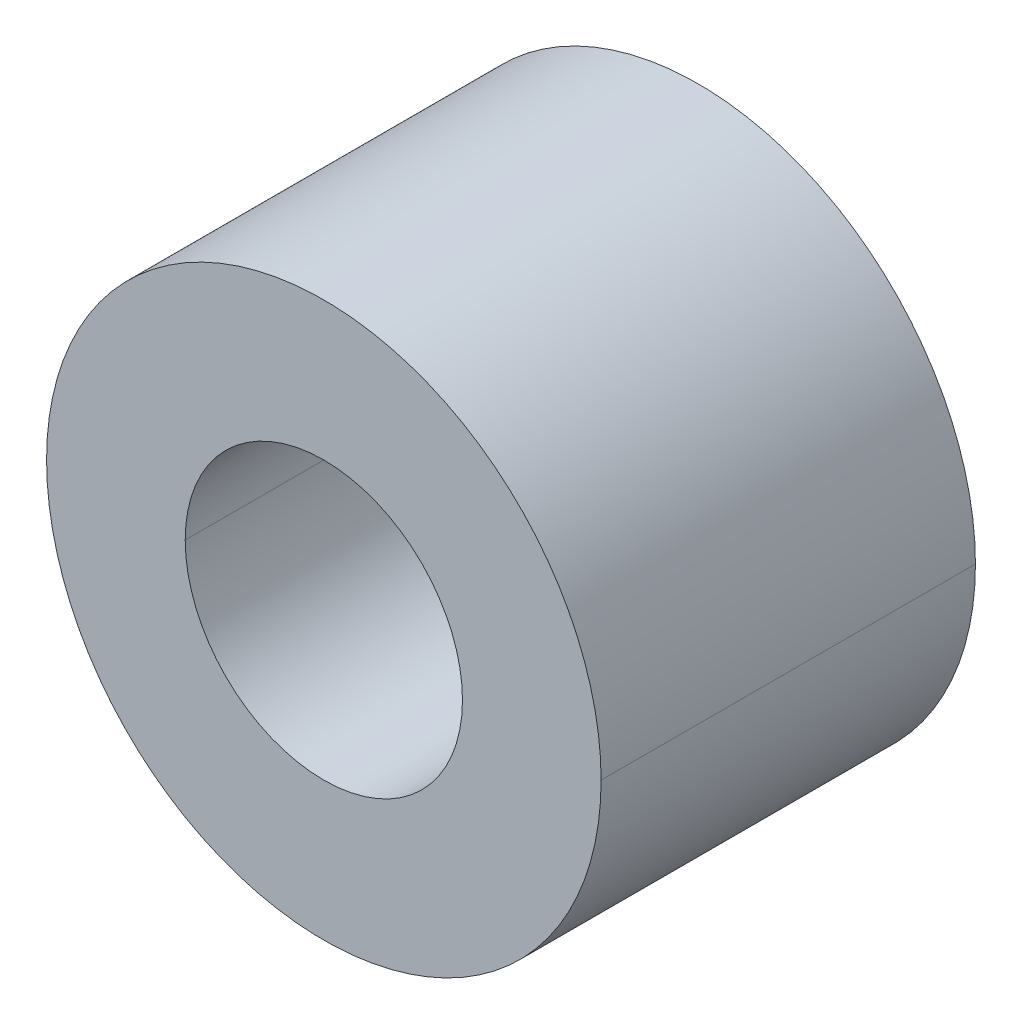
ISO-10303-21;
HEADER;
FILE_DESCRIPTION(('STEP AP214'),'2;1');
FILE_NAME('part.step','',(''),(''),'','','');
FILE_SCHEMA(('AUTOMOTIVE_DESIGN { 1 0 10303 214 1 1 1 1 }'));
ENDSEC;
DATA;
#1=APPLICATION_CONTEXT('core data for automotive mechanical design processes');
#2=APPLICATION_PROTOCOL_DEFINITION('international standard','automotive_design',2000,#1);
#3=PRODUCT_CONTEXT('',#1,'mechanical');
#4=PRODUCT('Part','Part','',(#3));
#5=PRODUCT_RELATED_PRODUCT_CATEGORY('part','',(#4));
#6=PRODUCT_DEFINITION_FORMATION('','',#4);
#7=PRODUCT_DEFINITION_CONTEXT('part definition',#1,'design');
#8=PRODUCT_DEFINITION('design','',#6,#7);
#9=PRODUCT_DEFINITION_SHAPE('','',#8);
#10=(LENGTH_UNIT() NAMED_UNIT(*) SI_UNIT(.MILLI.,.METRE.));
#11=(NAMED_UNIT(*) PLANE_ANGLE_UNIT() SI_UNIT($,.RADIAN.));
#12=(NAMED_UNIT(*) SI_UNIT($,.STERADIAN.) SOLID_ANGLE_UNIT());
#13=UNCERTAINTY_MEASURE_WITH_UNIT(LENGTH_MEASURE(1.E-05),#10,'distance_accuracy_value','');
#14=(GEOMETRIC_REPRESENTATION_CONTEXT(3) GLOBAL_UNCERTAINTY_ASSIGNED_CONTEXT((#13)) GLOBAL_UNIT_ASSIGNED_CONTEXT((#10,
#11,#12)) REPRESENTATION_CONTEXT('',''));
#15=CARTESIAN_POINT('',(0.,0.,0.));
#16=DIRECTION('',(0.,0.,1.));
#17=DIRECTION('',(1.,0.,0.));
#18=AXIS2_PLACEMENT_3D('',#15,#16,#17);
#19=CARTESIAN_POINT('',(0.,0.,2.7));
#20=DIRECTION('',(0.,0.,-1.));
#21=DIRECTION('',(-1.,0.,0.));
#22=AXIS2_PLACEMENT_3D('',#19,#20,#21);
#23=CYLINDRICAL_SURFACE('',#22,2.);
#24=CARTESIAN_POINT('',(0.,0.,2.7));
#25=DIRECTION('',(0.,0.,1.));
#26=DIRECTION('',(1.,0.,0.));
#27=AXIS2_PLACEMENT_3D('',#24,#25,#26);
#28=CIRCLE('',#27,2.);
#29=CARTESIAN_POINT('',(2.,0.,2.7));
#30=VERTEX_POINT('',#29);
#31=CARTESIAN_POINT('',(-2.,0.,2.7));
#32=VERTEX_POINT('',#31);
#33=EDGE_CURVE('E76',#30,#32,#28,.T.);
#34=ORIENTED_EDGE('',*,*,#33,.F.);
#35=DIRECTION('',(0.,0.,-1.));
#36=VECTOR('',#35,1.);
#37=CARTESIAN_POINT('',(2.,0.,2.69999999925));
#38=LINE('',#37,#36);
#39=CARTESIAN_POINT('',(2.,0.,7.45058237328E-10));
#40=VERTEX_POINT('',#39);
#41=EDGE_CURVE('E27',#30,#40,#38,.T.);
#42=ORIENTED_EDGE('',*,*,#41,.T.);
#43=CARTESIAN_POINT('',(0.,0.,0.));
#44=DIRECTION('',(0.,0.,1.));
#45=DIRECTION('',(1.,0.,0.));
#46=AXIS2_PLACEMENT_3D('',#43,#44,#45);
#47=CIRCLE('',#46,2.);
#48=CARTESIAN_POINT('',(-2.,0.,7.45058237328E-10));
#49=VERTEX_POINT('',#48);
#50=EDGE_CURVE('E74',#40,#49,#47,.T.);
#51=ORIENTED_EDGE('',*,*,#50,.T.);
#52=DIRECTION('',(0.,0.,-1.));
#53=VECTOR('',#52,1.);
#54=CARTESIAN_POINT('',(-2.,0.,2.69999999925));
#55=LINE('',#54,#53);
#56=EDGE_CURVE('E11',#32,#49,#55,.T.);
#57=ORIENTED_EDGE('',*,*,#56,.F.);
#58=EDGE_LOOP('',(#34,#42,#51,#57));
#59=FACE_BOUND('',#58,.T.);
#60=ADVANCED_FACE('F17',(#59),#23,.T.);
#61=CARTESIAN_POINT('',(0.,0.,2.7));
#62=DIRECTION('',(0.,0.,-1.));
#63=DIRECTION('',(-1.,0.,0.));
#64=AXIS2_PLACEMENT_3D('',#61,#62,#63);
#65=CYLINDRICAL_SURFACE('',#64,2.);
#66=ORIENTED_EDGE('',*,*,#41,.F.);
#67=CARTESIAN_POINT('',(0.,0.,2.7));
#68=DIRECTION('',(0.,0.,1.));
#69=DIRECTION('',(1.,0.,0.));
#70=AXIS2_PLACEMENT_3D('',#67,#68,#69);
#71=CIRCLE('',#70,2.);
#72=EDGE_CURVE('E70',#32,#30,#71,.T.);
#73=ORIENTED_EDGE('',*,*,#72,.F.);
#74=ORIENTED_EDGE('',*,*,#56,.T.);
#75=CARTESIAN_POINT('',(0.,0.,0.));
#76=DIRECTION('',(0.,0.,1.));
#77=DIRECTION('',(1.,0.,0.));
#78=AXIS2_PLACEMENT_3D('',#75,#76,#77);
#79=CIRCLE('',#78,2.);
#80=EDGE_CURVE('E72',#49,#40,#79,.T.);
#81=ORIENTED_EDGE('',*,*,#80,.T.);
#82=EDGE_LOOP('',(#66,#73,#74,#81));
#83=FACE_BOUND('',#82,.T.);
#84=ADVANCED_FACE('F68',(#83),#65,.T.);
#85=CARTESIAN_POINT('',(0.,0.,0.));
#86=DIRECTION('',(0.,0.,1.));
#87=DIRECTION('',(1.,0.,0.));
#88=AXIS2_PLACEMENT_3D('',#85,#86,#87);
#89=PLANE('',#88);
#90=CARTESIAN_POINT('',(-1.,0.,0.));
#91=CARTESIAN_POINT('',(-1.,-0.198634691643047,0.));
#92=CARTESIAN_POINT('',(-0.923780412003149,-0.382594922668909,0.));
#93=CARTESIAN_POINT('',(-0.847914141244922,-0.565702402813393,0.));
#94=CARTESIAN_POINT('',(-0.706883783869844,-0.706883783869469,0.));
#95=CARTESIAN_POINT('',(-0.566612412549211,-0.847305366103765,0.));
#96=CARTESIAN_POINT('',(-0.382594922668941,-0.923780412001884,0.));
#97=CARTESIAN_POINT('',(-0.199449738393865,-0.999892940123906,0.));
#98=CARTESIAN_POINT('',(0.,-0.999999999998,0.));
#99=CARTESIAN_POINT('',(0.198377685546573,-1.00010648441963,0.));
#100=CARTESIAN_POINT('',(0.38259492266894,-0.923780412001884,0.));
#101=CARTESIAN_POINT('',(0.565702402813467,-0.847914141244283,0.));
#102=CARTESIAN_POINT('',(0.706883783869844,-0.706883783869469,0.));
#103=CARTESIAN_POINT('',(0.847305366104299,-0.566612412549237,0.));
#104=CARTESIAN_POINT('',(0.92378041200315,-0.382594922668909,0.));
#105=CARTESIAN_POINT('',(1.,-0.199192126396722,0.));
#106=CARTESIAN_POINT('',(1.,0.,0.));
#107=B_SPLINE_CURVE_WITH_KNOTS('',2,(#90,#91,#92,#93,#94,#95,#96,#97,#98,#99,#100,#101,#102,
#103,#104,#105,#106),.UNSPECIFIED.,.F.,.F.,(3,2,2,2,2,2,2,2,3),(0.,0.125,0.25,0.375,0.5,0.625,
0.75,0.875,1.),.UNSPECIFIED.);
#108=CARTESIAN_POINT('',(-1.,0.,7.45058237328E-10));
#109=VERTEX_POINT('',#108);
#110=CARTESIAN_POINT('',(1.,0.,0.));
#111=VERTEX_POINT('',#110);
#112=EDGE_CURVE('E89',#109,#111,#107,.T.);
#113=ORIENTED_EDGE('',*,*,#112,.T.);
#114=CARTESIAN_POINT('',(0.,0.,7.45058237328E-10));
#115=DIRECTION('',(0.,0.,1.));
#116=DIRECTION('',(1.,0.,0.));
#117=AXIS2_PLACEMENT_3D('',#114,#115,#116);
#118=CIRCLE('',#117,1.);
#119=EDGE_CURVE('E127',#111,#109,#118,.T.);
#120=ORIENTED_EDGE('',*,*,#119,.T.);
#121=EDGE_LOOP('',(#113,#120));
#122=FACE_BOUND('',#121,.T.);
#123=ORIENTED_EDGE('',*,*,#80,.F.);
#124=ORIENTED_EDGE('',*,*,#50,.F.);
#125=EDGE_LOOP('',(#123,#124));
#126=FACE_BOUND('',#125,.T.);
#127=ADVANCED_FACE('F108',(#122,#126),#89,.F.);
#128=CARTESIAN_POINT('',(0.,0.,2.7));
#129=DIRECTION('',(0.,0.,-1.));
#130=DIRECTION('',(-1.,0.,0.));
#131=AXIS2_PLACEMENT_3D('',#128,#129,#130);
#132=CYLINDRICAL_SURFACE('',#131,1.);
#133=DIRECTION('',(0.,0.,-1.));
#134=VECTOR('',#133,1.);
#135=CARTESIAN_POINT('',(1.,0.,2.69999999925));
#136=LINE('',#135,#134);
#137=CARTESIAN_POINT('',(1.,0.,2.7));
#138=VERTEX_POINT('',#137);
#139=EDGE_CURVE('E95',#138,#111,#136,.T.);
#140=ORIENTED_EDGE('',*,*,#139,.F.);
#141=CARTESIAN_POINT('',(0.,0.,2.7));
#142=DIRECTION('',(0.,0.,1.));
#143=DIRECTION('',(1.,0.,0.));
#144=AXIS2_PLACEMENT_3D('',#141,#142,#143);
#145=CIRCLE('',#144,1.);
#146=CARTESIAN_POINT('',(-1.,0.,2.7));
#147=VERTEX_POINT('',#146);
#148=EDGE_CURVE('E79',#138,#147,#145,.T.);
#149=ORIENTED_EDGE('',*,*,#148,.T.);
#150=DIRECTION('',(0.,0.,-1.));
#151=VECTOR('',#150,1.);
#152=CARTESIAN_POINT('',(-1.,0.,2.69999999925));
#153=LINE('',#152,#151);
#154=EDGE_CURVE('E83',#147,#109,#153,.T.);
#155=ORIENTED_EDGE('',*,*,#154,.T.);
#156=ORIENTED_EDGE('',*,*,#119,.F.);
#157=EDGE_LOOP('',(#140,#149,#155,#156));
#158=FACE_BOUND('',#157,.T.);
#159=ADVANCED_FACE('F118',(#158),#132,.F.);
#160=CARTESIAN_POINT('',(0.,0.,2.7));
#161=DIRECTION('',(0.,0.,1.));
#162=DIRECTION('',(1.,0.,0.));
#163=AXIS2_PLACEMENT_3D('',#160,#161,#162);
#164=PLANE('',#163);
#165=CARTESIAN_POINT('',(0.,0.,2.7));
#166=DIRECTION('',(0.,0.,1.));
#167=DIRECTION('',(1.,0.,0.));
#168=AXIS2_PLACEMENT_3D('',#165,#166,#167);
#169=CIRCLE('',#168,1.);
#170=EDGE_CURVE('E92',#147,#138,#169,.T.);
#171=ORIENTED_EDGE('',*,*,#170,.F.);
#172=ORIENTED_EDGE('',*,*,#148,.F.);
#173=EDGE_LOOP('',(#171,#172));
#174=FACE_BOUND('',#173,.T.);
#175=ORIENTED_EDGE('',*,*,#72,.T.);
#176=ORIENTED_EDGE('',*,*,#33,.T.);
#177=EDGE_LOOP('',(#175,#176));
#178=FACE_BOUND('',#177,.T.);
#179=ADVANCED_FACE('F81',(#174,#178),#164,.T.);
#180=CARTESIAN_POINT('',(0.,0.,2.7));
#181=DIRECTION('',(0.,0.,-1.));
#182=DIRECTION('',(-1.,0.,0.));
#183=AXIS2_PLACEMENT_3D('',#180,#181,#182);
#184=CYLINDRICAL_SURFACE('',#183,1.);
#185=ORIENTED_EDGE('',*,*,#170,.T.);
#186=ORIENTED_EDGE('',*,*,#139,.T.);
#187=ORIENTED_EDGE('',*,*,#112,.F.);
#188=ORIENTED_EDGE('',*,*,#154,.F.);
#189=EDGE_LOOP('',(#185,#186,#187,#188));
#190=FACE_BOUND('',#189,.T.);
#191=ADVANCED_FACE('F120',(#190),#184,.F.);
#192=CLOSED_SHELL('',(#60,#84,#127,#159,#179,#191));
#193=MANIFOLD_SOLID_BREP('B1',#192);
#194=ADVANCED_BREP_SHAPE_REPRESENTATION('',(#18,#193),#14);
#195=SHAPE_DEFINITION_REPRESENTATION(#9,#194);
ENDSEC;
END-ISO-10303-21;
